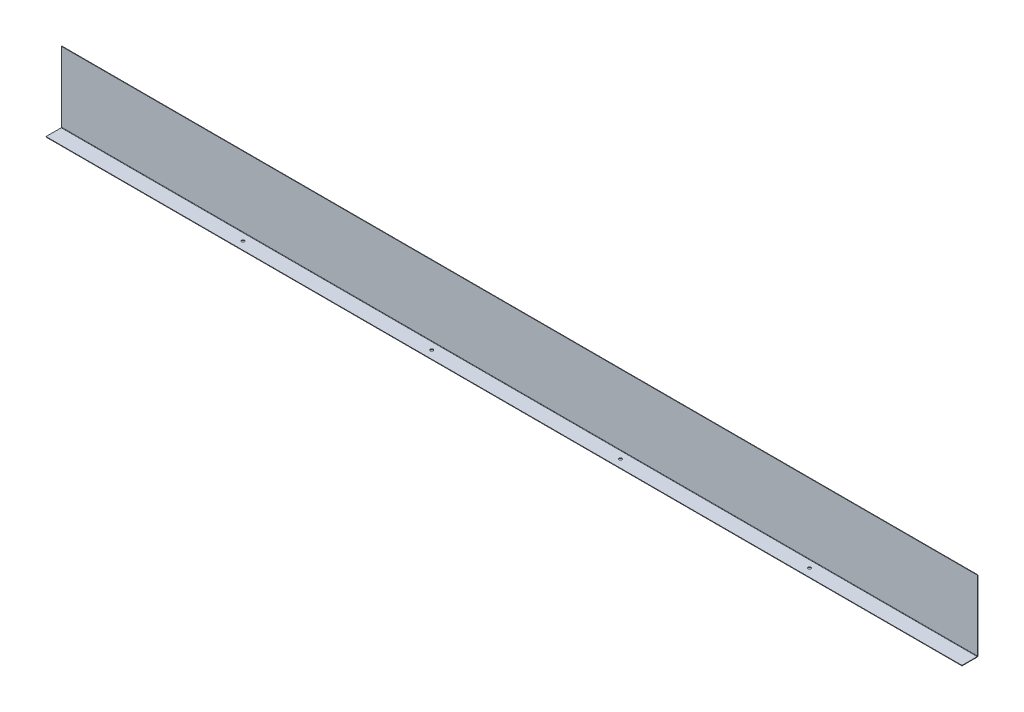
ISO-10303-21;
HEADER;
FILE_DESCRIPTION(('STEP AP214'),'2;1');
FILE_NAME('part.step','',(''),(''),'','','');
FILE_SCHEMA(('AUTOMOTIVE_DESIGN { 1 0 10303 214 1 1 1 1 }'));
ENDSEC;
DATA;
#1=APPLICATION_CONTEXT('core data for automotive mechanical design processes');
#2=APPLICATION_PROTOCOL_DEFINITION('international standard','automotive_design',2000,#1);
#3=PRODUCT_CONTEXT('',#1,'mechanical');
#4=PRODUCT('Part','Part','',(#3));
#5=PRODUCT_RELATED_PRODUCT_CATEGORY('part','',(#4));
#6=PRODUCT_DEFINITION_FORMATION('','',#4);
#7=PRODUCT_DEFINITION_CONTEXT('part definition',#1,'design');
#8=PRODUCT_DEFINITION('design','',#6,#7);
#9=PRODUCT_DEFINITION_SHAPE('','',#8);
#10=(LENGTH_UNIT() NAMED_UNIT(*) SI_UNIT(.MILLI.,.METRE.));
#11=(NAMED_UNIT(*) PLANE_ANGLE_UNIT() SI_UNIT($,.RADIAN.));
#12=(NAMED_UNIT(*) SI_UNIT($,.STERADIAN.) SOLID_ANGLE_UNIT());
#13=UNCERTAINTY_MEASURE_WITH_UNIT(LENGTH_MEASURE(1.E-05),#10,'distance_accuracy_value','');
#14=(GEOMETRIC_REPRESENTATION_CONTEXT(3) GLOBAL_UNCERTAINTY_ASSIGNED_CONTEXT((#13)) GLOBAL_UNIT_ASSIGNED_CONTEXT((#10,
#11,#12)) REPRESENTATION_CONTEXT('',''));
#15=CARTESIAN_POINT('',(0.,0.,0.));
#16=DIRECTION('',(0.,0.,1.));
#17=DIRECTION('',(1.,0.,0.));
#18=AXIS2_PLACEMENT_3D('',#15,#16,#17);
#19=CARTESIAN_POINT('',(1940.,-1.,0.));
#20=DIRECTION('',(0.,1.,0.));
#21=DIRECTION('',(0.,0.,1.));
#22=AXIS2_PLACEMENT_3D('',#19,#20,#21);
#23=PLANE('',#22);
#24=CARTESIAN_POINT('',(400.,-0.999999999999999,-16.95));
#25=DIRECTION('',(0.,1.,0.));
#26=DIRECTION('',(0.,0.,1.));
#27=AXIS2_PLACEMENT_3D('',#24,#25,#26);
#28=CIRCLE('',#27,2.99999999999999);
#29=CARTESIAN_POINT('',(400.,-0.999999999999999,-13.95));
#30=VERTEX_POINT('',#29);
#31=EDGE_CURVE('E227',#30,#30,#28,.T.);
#32=ORIENTED_EDGE('',*,*,#31,.T.);
#33=EDGE_LOOP('',(#32));
#34=FACE_BOUND('',#33,.T.);
#35=CARTESIAN_POINT('',(1200.,-0.999999999999999,-16.95));
#36=DIRECTION('',(0.,1.,0.));
#37=DIRECTION('',(0.,0.,1.));
#38=AXIS2_PLACEMENT_3D('',#35,#36,#37);
#39=CIRCLE('',#38,2.99999999999993);
#40=CARTESIAN_POINT('',(1200.,-0.999999999999999,-13.9500000000001));
#41=VERTEX_POINT('',#40);
#42=EDGE_CURVE('E231',#41,#41,#39,.T.);
#43=ORIENTED_EDGE('',*,*,#42,.T.);
#44=EDGE_LOOP('',(#43));
#45=FACE_BOUND('',#44,.T.);
#46=CARTESIAN_POINT('',(1600.,-0.999999999999999,-16.95));
#47=DIRECTION('',(0.,1.,0.));
#48=DIRECTION('',(0.,0.,1.));
#49=AXIS2_PLACEMENT_3D('',#46,#47,#48);
#50=CIRCLE('',#49,2.99999999999993);
#51=CARTESIAN_POINT('',(1600.,-0.999999999999999,-13.9500000000001));
#52=VERTEX_POINT('',#51);
#53=EDGE_CURVE('E235',#52,#52,#50,.T.);
#54=ORIENTED_EDGE('',*,*,#53,.T.);
#55=EDGE_LOOP('',(#54));
#56=FACE_BOUND('',#55,.T.);
#57=CARTESIAN_POINT('',(800.,-0.999999999999999,-16.95));
#58=DIRECTION('',(0.,1.,0.));
#59=DIRECTION('',(0.,0.,1.));
#60=AXIS2_PLACEMENT_3D('',#57,#58,#59);
#61=CIRCLE('',#60,3.00000000000005);
#62=CARTESIAN_POINT('',(800.,-0.999999999999999,-13.95));
#63=VERTEX_POINT('',#62);
#64=EDGE_CURVE('E162',#63,#63,#61,.T.);
#65=ORIENTED_EDGE('',*,*,#64,.T.);
#66=EDGE_LOOP('',(#65));
#67=FACE_BOUND('',#66,.T.);
#68=DIRECTION('',(-1.,0.,0.));
#69=VECTOR('',#68,1.);
#70=CARTESIAN_POINT('',(0.,-1.00000000000013,-32.1634));
#71=LINE('',#70,#69);
#72=CARTESIAN_POINT('',(0.,-1.00000000000013,-32.1634));
#73=VERTEX_POINT('',#72);
#74=CARTESIAN_POINT('',(1940.,-1.,-32.1634));
#75=VERTEX_POINT('',#74);
#76=EDGE_CURVE('E85',#73,#75,#71,.F.);
#77=ORIENTED_EDGE('',*,*,#76,.T.);
#78=DIRECTION('',(0.,0.,-1.));
#79=VECTOR('',#78,1.);
#80=CARTESIAN_POINT('',(1940.,-1.,0.));
#81=LINE('',#80,#79);
#82=CARTESIAN_POINT('',(1940.,-1.,0.));
#83=VERTEX_POINT('',#82);
#84=EDGE_CURVE('E186',#83,#75,#81,.T.);
#85=ORIENTED_EDGE('',*,*,#84,.F.);
#86=DIRECTION('',(-1.,0.,0.));
#87=VECTOR('',#86,1.);
#88=CARTESIAN_POINT('',(1940.,-1.,0.));
#89=LINE('',#88,#87);
#90=CARTESIAN_POINT('',(0.,-1.,0.));
#91=VERTEX_POINT('',#90);
#92=EDGE_CURVE('E65',#83,#91,#89,.T.);
#93=ORIENTED_EDGE('',*,*,#92,.T.);
#94=DIRECTION('',(0.,0.,-1.));
#95=VECTOR('',#94,1.);
#96=CARTESIAN_POINT('',(0.,-1.,0.));
#97=LINE('',#96,#95);
#98=EDGE_CURVE('E183',#91,#73,#97,.T.);
#99=ORIENTED_EDGE('',*,*,#98,.T.);
#100=EDGE_LOOP('',(#77,#85,#93,#99));
#101=FACE_BOUND('',#100,.T.);
#102=ADVANCED_FACE('F57',(#34,#45,#56,#67,#101),#23,.F.);
#103=CARTESIAN_POINT('',(1940.,0.,0.));
#104=DIRECTION('',(0.,1.,0.));
#105=DIRECTION('',(0.,0.,1.));
#106=AXIS2_PLACEMENT_3D('',#103,#104,#105);
#107=PLANE('',#106);
#108=CARTESIAN_POINT('',(400.,0.,-16.95));
#109=DIRECTION('',(0.,1.,0.));
#110=DIRECTION('',(0.,0.,1.));
#111=AXIS2_PLACEMENT_3D('',#108,#109,#110);
#112=CIRCLE('',#111,2.99999999999999);
#113=CARTESIAN_POINT('',(400.,0.,-13.95));
#114=VERTEX_POINT('',#113);
#115=EDGE_CURVE('E425',#114,#114,#112,.T.);
#116=ORIENTED_EDGE('',*,*,#115,.F.);
#117=EDGE_LOOP('',(#116));
#118=FACE_BOUND('',#117,.T.);
#119=CARTESIAN_POINT('',(1200.,0.,-16.95));
#120=DIRECTION('',(0.,1.,0.));
#121=DIRECTION('',(0.,0.,1.));
#122=AXIS2_PLACEMENT_3D('',#119,#120,#121);
#123=CIRCLE('',#122,2.99999999999993);
#124=CARTESIAN_POINT('',(1200.,0.,-13.9500000000001));
#125=VERTEX_POINT('',#124);
#126=EDGE_CURVE('E432',#125,#125,#123,.T.);
#127=ORIENTED_EDGE('',*,*,#126,.F.);
#128=EDGE_LOOP('',(#127));
#129=FACE_BOUND('',#128,.T.);
#130=CARTESIAN_POINT('',(1600.,0.,-16.95));
#131=DIRECTION('',(0.,1.,0.));
#132=DIRECTION('',(0.,0.,1.));
#133=AXIS2_PLACEMENT_3D('',#130,#131,#132);
#134=CIRCLE('',#133,2.99999999999993);
#135=CARTESIAN_POINT('',(1600.,0.,-13.9500000000001));
#136=VERTEX_POINT('',#135);
#137=EDGE_CURVE('E429',#136,#136,#134,.T.);
#138=ORIENTED_EDGE('',*,*,#137,.F.);
#139=EDGE_LOOP('',(#138));
#140=FACE_BOUND('',#139,.T.);
#141=CARTESIAN_POINT('',(800.,0.,-16.95));
#142=DIRECTION('',(0.,1.,0.));
#143=DIRECTION('',(0.,0.,1.));
#144=AXIS2_PLACEMENT_3D('',#141,#142,#143);
#145=CIRCLE('',#144,3.00000000000005);
#146=CARTESIAN_POINT('',(800.,0.,-13.95));
#147=VERTEX_POINT('',#146);
#148=EDGE_CURVE('E239',#147,#147,#145,.T.);
#149=ORIENTED_EDGE('',*,*,#148,.F.);
#150=EDGE_LOOP('',(#149));
#151=FACE_BOUND('',#150,.T.);
#152=DIRECTION('',(0.,0.,-1.));
#153=VECTOR('',#152,1.);
#154=CARTESIAN_POINT('',(1940.,0.,0.));
#155=LINE('',#154,#153);
#156=CARTESIAN_POINT('',(1940.,0.,0.));
#157=VERTEX_POINT('',#156);
#158=CARTESIAN_POINT('',(1940.,0.,-32.1634));
#159=VERTEX_POINT('',#158);
#160=EDGE_CURVE('E188',#157,#159,#155,.T.);
#161=ORIENTED_EDGE('',*,*,#160,.T.);
#162=DIRECTION('',(-1.,0.,0.));
#163=VECTOR('',#162,1.);
#164=CARTESIAN_POINT('',(0.,-1.25116930704827E-13,-32.1634));
#165=LINE('',#164,#163);
#166=CARTESIAN_POINT('',(0.,-1.25116930704827E-13,-32.1634));
#167=VERTEX_POINT('',#166);
#168=EDGE_CURVE('E174',#167,#159,#165,.F.);
#169=ORIENTED_EDGE('',*,*,#168,.F.);
#170=DIRECTION('',(0.,0.,-1.));
#171=VECTOR('',#170,1.);
#172=CARTESIAN_POINT('',(0.,0.,0.));
#173=LINE('',#172,#171);
#174=CARTESIAN_POINT('',(0.,0.,0.));
#175=VERTEX_POINT('',#174);
#176=EDGE_CURVE('E195',#175,#167,#173,.T.);
#177=ORIENTED_EDGE('',*,*,#176,.F.);
#178=DIRECTION('',(-1.,0.,0.));
#179=VECTOR('',#178,1.);
#180=CARTESIAN_POINT('',(1940.,0.,0.));
#181=LINE('',#180,#179);
#182=EDGE_CURVE('E13',#157,#175,#181,.T.);
#183=ORIENTED_EDGE('',*,*,#182,.F.);
#184=EDGE_LOOP('',(#161,#169,#177,#183));
#185=FACE_BOUND('',#184,.T.);
#186=ADVANCED_FACE('F218',(#118,#129,#140,#151,#185),#107,.T.);
#187=CARTESIAN_POINT('',(1940.,0.,0.));
#188=DIRECTION('',(-1.,0.,0.));
#189=DIRECTION('',(0.,0.,1.));
#190=AXIS2_PLACEMENT_3D('',#187,#188,#189);
#191=PLANE('',#190);
#192=DIRECTION('',(0.,-1.,0.));
#193=VECTOR('',#192,1.);
#194=CARTESIAN_POINT('',(1940.,0.,-32.1634));
#195=LINE('',#194,#193);
#196=EDGE_CURVE('E180',#159,#75,#195,.T.);
#197=ORIENTED_EDGE('',*,*,#196,.F.);
#198=ORIENTED_EDGE('',*,*,#160,.F.);
#199=DIRECTION('',(0.,1.,0.));
#200=VECTOR('',#199,1.);
#201=CARTESIAN_POINT('',(1940.,-1.,0.));
#202=LINE('',#201,#200);
#203=EDGE_CURVE('E192',#83,#157,#202,.T.);
#204=ORIENTED_EDGE('',*,*,#203,.F.);
#205=ORIENTED_EDGE('',*,*,#84,.T.);
#206=EDGE_LOOP('',(#197,#198,#204,#205));
#207=FACE_BOUND('',#206,.T.);
#208=ADVANCED_FACE('F215',(#207),#191,.F.);
#209=CARTESIAN_POINT('',(0.,0.,0.));
#210=DIRECTION('',(-1.,0.,0.));
#211=DIRECTION('',(0.,0.,1.));
#212=AXIS2_PLACEMENT_3D('',#209,#210,#211);
#213=PLANE('',#212);
#214=ORIENTED_EDGE('',*,*,#176,.T.);
#215=DIRECTION('',(0.,-1.,0.));
#216=VECTOR('',#215,1.);
#217=CARTESIAN_POINT('',(0.,-1.25116930704827E-13,-32.1634));
#218=LINE('',#217,#216);
#219=EDGE_CURVE('E168',#167,#73,#218,.T.);
#220=ORIENTED_EDGE('',*,*,#219,.T.);
#221=ORIENTED_EDGE('',*,*,#98,.F.);
#222=DIRECTION('',(0.,1.,0.));
#223=VECTOR('',#222,1.);
#224=CARTESIAN_POINT('',(0.,-1.,0.));
#225=LINE('',#224,#223);
#226=EDGE_CURVE('E189',#91,#175,#225,.T.);
#227=ORIENTED_EDGE('',*,*,#226,.T.);
#228=EDGE_LOOP('',(#214,#220,#221,#227));
#229=FACE_BOUND('',#228,.T.);
#230=ADVANCED_FACE('F202',(#229),#213,.T.);
#231=CARTESIAN_POINT('',(1940.,-1.,0.));
#232=DIRECTION('',(0.,0.,1.));
#233=DIRECTION('',(1.,0.,0.));
#234=AXIS2_PLACEMENT_3D('',#231,#232,#233);
#235=PLANE('',#234);
#236=ORIENTED_EDGE('',*,*,#226,.F.);
#237=ORIENTED_EDGE('',*,*,#92,.F.);
#238=ORIENTED_EDGE('',*,*,#203,.T.);
#239=ORIENTED_EDGE('',*,*,#182,.T.);
#240=EDGE_LOOP('',(#236,#237,#238,#239));
#241=FACE_BOUND('',#240,.T.);
#242=ADVANCED_FACE('F204',(#241),#235,.T.);
#243=CARTESIAN_POINT('',(1940.,0.736600000000015,-32.1634));
#244=DIRECTION('',(1.,0.,0.));
#245=DIRECTION('',(0.,1.,0.));
#246=AXIS2_PLACEMENT_3D('',#243,#244,#245);
#247=PLANE('',#246);
#248=DIRECTION('',(0.,0.,1.));
#249=VECTOR('',#248,1.);
#250=CARTESIAN_POINT('',(1940.,0.736600000000004,-33.9));
#251=LINE('',#250,#249);
#252=CARTESIAN_POINT('',(1940.,0.736600000000012,-32.9));
#253=VERTEX_POINT('',#252);
#254=CARTESIAN_POINT('',(1940.,0.736600000000009,-33.9));
#255=VERTEX_POINT('',#254);
#256=EDGE_CURVE('E145',#253,#255,#251,.F.);
#257=ORIENTED_EDGE('',*,*,#256,.F.);
#258=CARTESIAN_POINT('',(1940.,0.736600000000015,-32.1634));
#259=DIRECTION('',(-1.,0.,0.));
#260=DIRECTION('',(0.,-1.,0.));
#261=AXIS2_PLACEMENT_3D('',#258,#259,#260);
#262=CIRCLE('',#261,0.736599999999997);
#263=EDGE_CURVE('E171',#159,#253,#262,.F.);
#264=ORIENTED_EDGE('',*,*,#263,.F.);
#265=ORIENTED_EDGE('',*,*,#196,.T.);
#266=CARTESIAN_POINT('',(1940.,0.736600000000015,-32.1634));
#267=DIRECTION('',(-1.,0.,0.));
#268=DIRECTION('',(0.,-1.,0.));
#269=AXIS2_PLACEMENT_3D('',#266,#267,#268);
#270=CIRCLE('',#269,1.7366);
#271=EDGE_CURVE('E164',#75,#255,#270,.F.);
#272=ORIENTED_EDGE('',*,*,#271,.T.);
#273=EDGE_LOOP('',(#257,#264,#265,#272));
#274=FACE_BOUND('',#273,.T.);
#275=ADVANCED_FACE('F206',(#274),#247,.T.);
#276=CARTESIAN_POINT('',(0.,0.736599999999872,-32.1634));
#277=DIRECTION('',(1.,0.,0.));
#278=DIRECTION('',(0.,1.,0.));
#279=AXIS2_PLACEMENT_3D('',#276,#277,#278);
#280=PLANE('',#279);
#281=CARTESIAN_POINT('',(0.,0.736599999999872,-32.1634));
#282=DIRECTION('',(-1.,0.,0.));
#283=DIRECTION('',(0.,-1.,0.));
#284=AXIS2_PLACEMENT_3D('',#281,#282,#283);
#285=CIRCLE('',#284,0.736599999999997);
#286=CARTESIAN_POINT('',(0.,0.736599999999869,-32.9));
#287=VERTEX_POINT('',#286);
#288=EDGE_CURVE('E177',#287,#167,#285,.T.);
#289=ORIENTED_EDGE('',*,*,#288,.F.);
#290=DIRECTION('',(0.,0.,1.));
#291=VECTOR('',#290,1.);
#292=CARTESIAN_POINT('',(0.,0.7365999999999,-32.9));
#293=LINE('',#292,#291);
#294=CARTESIAN_POINT('',(0.,0.736599999999907,-33.9));
#295=VERTEX_POINT('',#294);
#296=EDGE_CURVE('E156',#287,#295,#293,.F.);
#297=ORIENTED_EDGE('',*,*,#296,.T.);
#298=CARTESIAN_POINT('',(0.,0.736599999999872,-32.1634));
#299=DIRECTION('',(-1.,0.,0.));
#300=DIRECTION('',(0.,-1.,0.));
#301=AXIS2_PLACEMENT_3D('',#298,#299,#300);
#302=CIRCLE('',#301,1.7366);
#303=EDGE_CURVE('E165',#295,#73,#302,.T.);
#304=ORIENTED_EDGE('',*,*,#303,.T.);
#305=ORIENTED_EDGE('',*,*,#219,.F.);
#306=EDGE_LOOP('',(#289,#297,#304,#305));
#307=FACE_BOUND('',#306,.T.);
#308=ADVANCED_FACE('F212',(#307),#280,.F.);
#309=CARTESIAN_POINT('',(0.,0.736599999999872,-32.1634));
#310=DIRECTION('',(-1.,0.,0.));
#311=DIRECTION('',(0.,0.,-1.));
#312=AXIS2_PLACEMENT_3D('',#309,#310,#311);
#313=CYLINDRICAL_SURFACE('',#312,1.7366);
#314=ORIENTED_EDGE('',*,*,#76,.F.);
#315=ORIENTED_EDGE('',*,*,#303,.F.);
#316=DIRECTION('',(-1.,0.,0.));
#317=VECTOR('',#316,1.);
#318=CARTESIAN_POINT('',(1940.,0.736600000000004,-33.9));
#319=LINE('',#318,#317);
#320=EDGE_CURVE('E154',#295,#255,#319,.F.);
#321=ORIENTED_EDGE('',*,*,#320,.T.);
#322=ORIENTED_EDGE('',*,*,#271,.F.);
#323=EDGE_LOOP('',(#314,#315,#321,#322));
#324=FACE_BOUND('',#323,.T.);
#325=ADVANCED_FACE('F268',(#324),#313,.T.);
#326=CARTESIAN_POINT('',(0.,0.736599999999872,-32.1634));
#327=DIRECTION('',(-1.,0.,0.));
#328=DIRECTION('',(0.,0.,-1.));
#329=AXIS2_PLACEMENT_3D('',#326,#327,#328);
#330=CYLINDRICAL_SURFACE('',#329,0.736599999999997);
#331=ORIENTED_EDGE('',*,*,#168,.T.);
#332=ORIENTED_EDGE('',*,*,#263,.T.);
#333=DIRECTION('',(-1.,0.,0.));
#334=VECTOR('',#333,1.);
#335=CARTESIAN_POINT('',(1940.,0.736599999999997,-32.9));
#336=LINE('',#335,#334);
#337=EDGE_CURVE('E159',#253,#287,#336,.T.);
#338=ORIENTED_EDGE('',*,*,#337,.T.);
#339=ORIENTED_EDGE('',*,*,#288,.T.);
#340=EDGE_LOOP('',(#331,#332,#338,#339));
#341=FACE_BOUND('',#340,.T.);
#342=ADVANCED_FACE('F252',(#341),#330,.F.);
#343=CARTESIAN_POINT('',(1940.,0.,-33.9));
#344=DIRECTION('',(-1.,0.,0.));
#345=DIRECTION('',(0.,0.,1.));
#346=AXIS2_PLACEMENT_3D('',#343,#344,#345);
#347=PLANE('',#346);
#348=ORIENTED_EDGE('',*,*,#256,.T.);
#349=DIRECTION('',(0.,-1.,0.));
#350=VECTOR('',#349,1.);
#351=CARTESIAN_POINT('',(1940.,-1.21895090403837E-13,-33.9));
#352=LINE('',#351,#350);
#353=CARTESIAN_POINT('',(1940.,149.,-33.9000000000005));
#354=VERTEX_POINT('',#353);
#355=EDGE_CURVE('E126',#354,#255,#352,.T.);
#356=ORIENTED_EDGE('',*,*,#355,.F.);
#357=DIRECTION('',(0.,0.,1.));
#358=VECTOR('',#357,1.);
#359=CARTESIAN_POINT('',(1940.,149.,-33.9000000000005));
#360=LINE('',#359,#358);
#361=CARTESIAN_POINT('',(1940.,149.,-32.9000000000005));
#362=VERTEX_POINT('',#361);
#363=EDGE_CURVE('E132',#354,#362,#360,.T.);
#364=ORIENTED_EDGE('',*,*,#363,.T.);
#365=DIRECTION('',(0.,1.,0.));
#366=VECTOR('',#365,1.);
#367=CARTESIAN_POINT('',(1940.,0.,-32.9));
#368=LINE('',#367,#366);
#369=EDGE_CURVE('E152',#362,#253,#368,.F.);
#370=ORIENTED_EDGE('',*,*,#369,.T.);
#371=EDGE_LOOP('',(#348,#356,#364,#370));
#372=FACE_BOUND('',#371,.T.);
#373=ADVANCED_FACE('F144',(#372),#347,.F.);
#374=CARTESIAN_POINT('',(0.,149.,-33.9000000000005));
#375=DIRECTION('',(1.,0.,0.));
#376=DIRECTION('',(0.,0.,-1.));
#377=AXIS2_PLACEMENT_3D('',#374,#375,#376);
#378=PLANE('',#377);
#379=ORIENTED_EDGE('',*,*,#296,.F.);
#380=DIRECTION('',(0.,-1.,0.));
#381=VECTOR('',#380,1.);
#382=CARTESIAN_POINT('',(0.,149.,-32.9000000000005));
#383=LINE('',#382,#381);
#384=CARTESIAN_POINT('',(0.,149.,-32.9000000000005));
#385=VERTEX_POINT('',#384);
#386=EDGE_CURVE('E148',#287,#385,#383,.F.);
#387=ORIENTED_EDGE('',*,*,#386,.T.);
#388=DIRECTION('',(0.,0.,1.));
#389=VECTOR('',#388,1.);
#390=CARTESIAN_POINT('',(0.,149.,-33.9000000000005));
#391=LINE('',#390,#389);
#392=CARTESIAN_POINT('',(0.,149.,-33.9000000000005));
#393=VERTEX_POINT('',#392);
#394=EDGE_CURVE('E141',#393,#385,#391,.T.);
#395=ORIENTED_EDGE('',*,*,#394,.F.);
#396=DIRECTION('',(0.,1.,0.));
#397=VECTOR('',#396,1.);
#398=CARTESIAN_POINT('',(0.,-1.21895090403837E-13,-33.9));
#399=LINE('',#398,#397);
#400=EDGE_CURVE('E128',#295,#393,#399,.T.);
#401=ORIENTED_EDGE('',*,*,#400,.F.);
#402=EDGE_LOOP('',(#379,#387,#395,#401));
#403=FACE_BOUND('',#402,.T.);
#404=ADVANCED_FACE('F256',(#403),#378,.F.);
#405=CARTESIAN_POINT('',(0.,-1.21895090403837E-13,-33.9));
#406=DIRECTION('',(0.,0.,1.));
#407=DIRECTION('',(0.,-1.,0.));
#408=AXIS2_PLACEMENT_3D('',#405,#406,#407);
#409=PLANE('',#408);
#410=ORIENTED_EDGE('',*,*,#320,.F.);
#411=ORIENTED_EDGE('',*,*,#400,.T.);
#412=DIRECTION('',(1.,0.,0.));
#413=VECTOR('',#412,1.);
#414=CARTESIAN_POINT('',(0.,149.,-33.9000000000005));
#415=LINE('',#414,#413);
#416=EDGE_CURVE('E121',#393,#354,#415,.T.);
#417=ORIENTED_EDGE('',*,*,#416,.T.);
#418=ORIENTED_EDGE('',*,*,#355,.T.);
#419=EDGE_LOOP('',(#410,#411,#417,#418));
#420=FACE_BOUND('',#419,.T.);
#421=ADVANCED_FACE('F124',(#420),#409,.F.);
#422=CARTESIAN_POINT('',(0.,-1.18403609064994E-13,-32.9));
#423=DIRECTION('',(0.,0.,1.));
#424=DIRECTION('',(0.,-1.,0.));
#425=AXIS2_PLACEMENT_3D('',#422,#423,#424);
#426=PLANE('',#425);
#427=ORIENTED_EDGE('',*,*,#386,.F.);
#428=ORIENTED_EDGE('',*,*,#337,.F.);
#429=ORIENTED_EDGE('',*,*,#369,.F.);
#430=DIRECTION('',(-1.,0.,0.));
#431=VECTOR('',#430,1.);
#432=CARTESIAN_POINT('',(1940.,149.,-32.9000000000005));
#433=LINE('',#432,#431);
#434=EDGE_CURVE('E137',#385,#362,#433,.F.);
#435=ORIENTED_EDGE('',*,*,#434,.F.);
#436=EDGE_LOOP('',(#427,#428,#429,#435));
#437=FACE_BOUND('',#436,.T.);
#438=ADVANCED_FACE('F248',(#437),#426,.T.);
#439=CARTESIAN_POINT('',(1940.,149.,-33.9000000000005));
#440=DIRECTION('',(0.,-1.,0.));
#441=DIRECTION('',(0.,0.,-1.));
#442=AXIS2_PLACEMENT_3D('',#439,#440,#441);
#443=PLANE('',#442);
#444=ORIENTED_EDGE('',*,*,#434,.T.);
#445=ORIENTED_EDGE('',*,*,#363,.F.);
#446=ORIENTED_EDGE('',*,*,#416,.F.);
#447=ORIENTED_EDGE('',*,*,#394,.T.);
#448=EDGE_LOOP('',(#444,#445,#446,#447));
#449=FACE_BOUND('',#448,.T.);
#450=ADVANCED_FACE('F135',(#449),#443,.F.);
#451=CARTESIAN_POINT('',(800.,-10.,-16.95));
#452=DIRECTION('',(0.,1.,0.));
#453=DIRECTION('',(0.,0.,1.));
#454=AXIS2_PLACEMENT_3D('',#451,#452,#453);
#455=CYLINDRICAL_SURFACE('',#454,3.00000000000005);
#456=ORIENTED_EDGE('',*,*,#148,.T.);
#457=EDGE_LOOP('',(#456));
#458=FACE_BOUND('',#457,.T.);
#459=ORIENTED_EDGE('',*,*,#64,.F.);
#460=EDGE_LOOP('',(#459));
#461=FACE_BOUND('',#460,.T.);
#462=ADVANCED_FACE('F355',(#458,#461),#455,.F.);
#463=CARTESIAN_POINT('',(1600.,-10.,-16.95));
#464=DIRECTION('',(0.,1.,0.));
#465=DIRECTION('',(0.,0.,1.));
#466=AXIS2_PLACEMENT_3D('',#463,#464,#465);
#467=CYLINDRICAL_SURFACE('',#466,2.99999999999993);
#468=ORIENTED_EDGE('',*,*,#137,.T.);
#469=EDGE_LOOP('',(#468));
#470=FACE_BOUND('',#469,.T.);
#471=ORIENTED_EDGE('',*,*,#53,.F.);
#472=EDGE_LOOP('',(#471));
#473=FACE_BOUND('',#472,.T.);
#474=ADVANCED_FACE('F363',(#470,#473),#467,.F.);
#475=CARTESIAN_POINT('',(1200.,-10.,-16.95));
#476=DIRECTION('',(0.,1.,0.));
#477=DIRECTION('',(0.,0.,1.));
#478=AXIS2_PLACEMENT_3D('',#475,#476,#477);
#479=CYLINDRICAL_SURFACE('',#478,2.99999999999993);
#480=ORIENTED_EDGE('',*,*,#126,.T.);
#481=EDGE_LOOP('',(#480));
#482=FACE_BOUND('',#481,.T.);
#483=ORIENTED_EDGE('',*,*,#42,.F.);
#484=EDGE_LOOP('',(#483));
#485=FACE_BOUND('',#484,.T.);
#486=ADVANCED_FACE('F382',(#482,#485),#479,.F.);
#487=CARTESIAN_POINT('',(400.,-10.,-16.95));
#488=DIRECTION('',(0.,1.,0.));
#489=DIRECTION('',(0.,0.,1.));
#490=AXIS2_PLACEMENT_3D('',#487,#488,#489);
#491=CYLINDRICAL_SURFACE('',#490,2.99999999999999);
#492=ORIENTED_EDGE('',*,*,#115,.T.);
#493=EDGE_LOOP('',(#492));
#494=FACE_BOUND('',#493,.T.);
#495=ORIENTED_EDGE('',*,*,#31,.F.);
#496=EDGE_LOOP('',(#495));
#497=FACE_BOUND('',#496,.T.);
#498=ADVANCED_FACE('F393',(#494,#497),#491,.F.);
#499=CLOSED_SHELL('',(#102,#186,#208,#230,#242,#275,#308,#325,#342,#373,#404,#421,#438,#450,
#462,#474,#486,#498));
#500=MANIFOLD_SOLID_BREP('B2',#499);
#501=ADVANCED_BREP_SHAPE_REPRESENTATION('',(#18,#500),#14);
#502=SHAPE_DEFINITION_REPRESENTATION(#9,#501);
ENDSEC;
END-ISO-10303-21;
